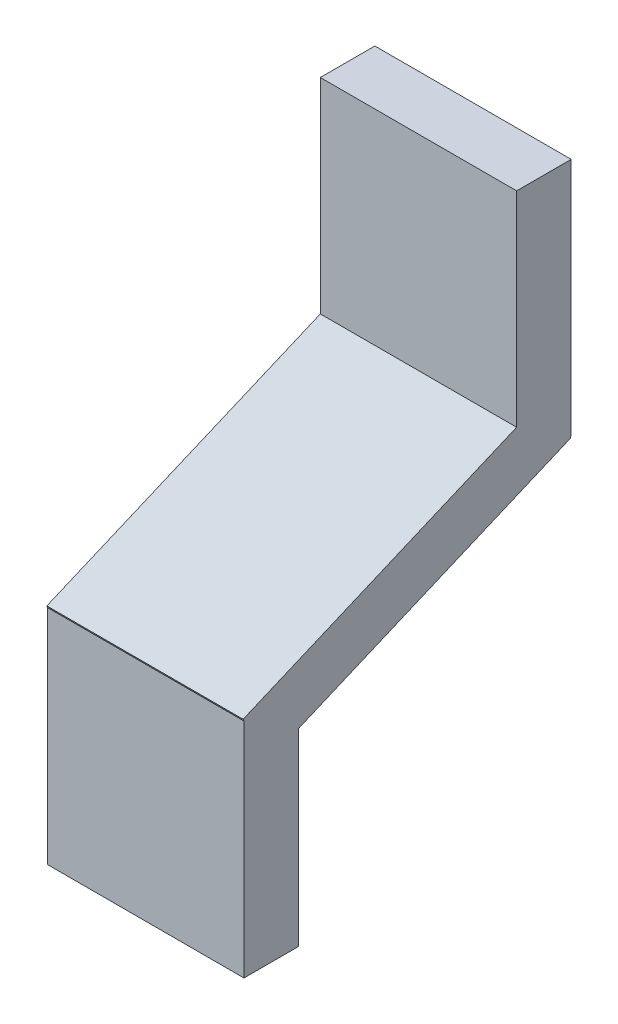
ISO-10303-21;
HEADER;
FILE_DESCRIPTION(('STEP AP214'),'2;1');
FILE_NAME('part.step','',(''),(''),'','','');
FILE_SCHEMA(('AUTOMOTIVE_DESIGN { 1 0 10303 214 1 1 1 1 }'));
ENDSEC;
DATA;
#1=APPLICATION_CONTEXT('core data for automotive mechanical design processes');
#2=APPLICATION_PROTOCOL_DEFINITION('international standard','automotive_design',2000,#1);
#3=PRODUCT_CONTEXT('',#1,'mechanical');
#4=PRODUCT('Part','Part','',(#3));
#5=PRODUCT_RELATED_PRODUCT_CATEGORY('part','',(#4));
#6=PRODUCT_DEFINITION_FORMATION('','',#4);
#7=PRODUCT_DEFINITION_CONTEXT('part definition',#1,'design');
#8=PRODUCT_DEFINITION('design','',#6,#7);
#9=PRODUCT_DEFINITION_SHAPE('','',#8);
#10=(LENGTH_UNIT() NAMED_UNIT(*) SI_UNIT(.MILLI.,.METRE.));
#11=(NAMED_UNIT(*) PLANE_ANGLE_UNIT() SI_UNIT($,.RADIAN.));
#12=(NAMED_UNIT(*) SI_UNIT($,.STERADIAN.) SOLID_ANGLE_UNIT());
#13=UNCERTAINTY_MEASURE_WITH_UNIT(LENGTH_MEASURE(1.E-05),#10,'distance_accuracy_value','');
#14=(GEOMETRIC_REPRESENTATION_CONTEXT(3) GLOBAL_UNCERTAINTY_ASSIGNED_CONTEXT((#13)) GLOBAL_UNIT_ASSIGNED_CONTEXT((#10,
#11,#12)) REPRESENTATION_CONTEXT('',''));
#15=CARTESIAN_POINT('',(0.,0.,0.));
#16=DIRECTION('',(0.,0.,1.));
#17=DIRECTION('',(1.,0.,0.));
#18=AXIS2_PLACEMENT_3D('',#15,#16,#17);
#19=CARTESIAN_POINT('',(4.22,11.,0.5));
#20=DIRECTION('',(0.,0.,1.));
#21=DIRECTION('',(1.,0.,0.));
#22=AXIS2_PLACEMENT_3D('',#19,#20,#21);
#23=PLANE('',#22);
#24=DIRECTION('',(1.,0.,0.));
#25=VECTOR('',#24,1.);
#26=CARTESIAN_POINT('',(4.22,11.3461054439247,0.500000000000314));
#27=LINE('',#26,#25);
#28=CARTESIAN_POINT('',(4.580000014305,11.3461054439242,0.500000000000105));
#29=VERTEX_POINT('',#28);
#30=CARTESIAN_POINT('',(4.22,11.3461054439243,0.500000000000105));
#31=VERTEX_POINT('',#30);
#32=EDGE_CURVE('E148',#29,#31,#27,.F.);
#33=ORIENTED_EDGE('',*,*,#32,.F.);
#34=DIRECTION('',(0.,1.,0.));
#35=VECTOR('',#34,1.);
#36=CARTESIAN_POINT('',(4.580000014305,11.65,0.5));
#37=LINE('',#36,#35);
#38=CARTESIAN_POINT('',(4.580000014305,11.,0.5));
#39=VERTEX_POINT('',#38);
#40=EDGE_CURVE('E154',#39,#29,#37,.T.);
#41=ORIENTED_EDGE('',*,*,#40,.F.);
#42=DIRECTION('',(1.,0.,0.));
#43=VECTOR('',#42,1.);
#44=CARTESIAN_POINT('',(4.22,11.,0.5));
#45=LINE('',#44,#43);
#46=CARTESIAN_POINT('',(4.22,11.,0.5));
#47=VERTEX_POINT('',#46);
#48=EDGE_CURVE('E135',#39,#47,#45,.F.);
#49=ORIENTED_EDGE('',*,*,#48,.T.);
#50=DIRECTION('',(0.,1.,0.));
#51=VECTOR('',#50,1.);
#52=CARTESIAN_POINT('',(4.22,11.65,0.5));
#53=LINE('',#52,#51);
#54=EDGE_CURVE('E182',#47,#31,#53,.T.);
#55=ORIENTED_EDGE('',*,*,#54,.T.);
#56=EDGE_LOOP('',(#33,#41,#49,#55));
#57=FACE_BOUND('',#56,.T.);
#58=ADVANCED_FACE('F17',(#57),#23,.F.);
#59=CARTESIAN_POINT('',(4.22,11.557949520001,0.0009268707435866));
#60=DIRECTION('',(0.,-0.920504786278108,-0.390731286742046));
#61=DIRECTION('',(0.,0.390731286742046,-0.920504786278108));
#62=AXIS2_PLACEMENT_3D('',#59,#60,#61);
#63=PLANE('',#62);
#64=DIRECTION('',(0.,0.39073128674346,-0.920504786277508));
#65=VECTOR('',#64,1.);
#66=CARTESIAN_POINT('',(4.580000014305,11.346105443924,0.5));
#67=LINE('',#66,#65);
#68=CARTESIAN_POINT('',(4.580000014305,11.557949520001,0.000926870743687937));
#69=VERTEX_POINT('',#68);
#70=EDGE_CURVE('E151',#29,#69,#67,.T.);
#71=ORIENTED_EDGE('',*,*,#70,.F.);
#72=ORIENTED_EDGE('',*,*,#32,.T.);
#73=DIRECTION('',(0.,0.39073128674346,-0.920504786277508));
#74=VECTOR('',#73,1.);
#75=CARTESIAN_POINT('',(4.22,11.346105443924,0.5));
#76=LINE('',#75,#74);
#77=CARTESIAN_POINT('',(4.22,11.557949520001,0.000926870743697301));
#78=VERTEX_POINT('',#77);
#79=EDGE_CURVE('E178',#31,#78,#76,.T.);
#80=ORIENTED_EDGE('',*,*,#79,.T.);
#81=DIRECTION('',(1.,0.,0.));
#82=VECTOR('',#81,1.);
#83=CARTESIAN_POINT('',(4.22,11.557949520001,0.00092687074374427));
#84=LINE('',#83,#82);
#85=EDGE_CURVE('E145',#78,#69,#84,.T.);
#86=ORIENTED_EDGE('',*,*,#85,.T.);
#87=EDGE_LOOP('',(#71,#72,#80,#86));
#88=FACE_BOUND('',#87,.T.);
#89=ADVANCED_FACE('F242',(#88),#63,.T.);
#90=CARTESIAN_POINT('',(4.22,11.65,0.04));
#91=DIRECTION('',(0.,-0.390731286742046,0.920504786278108));
#92=DIRECTION('',(0.,-0.920504786278108,-0.390731286742046));
#93=AXIS2_PLACEMENT_3D('',#90,#91,#92);
#94=PLANE('',#93);
#95=DIRECTION('',(0.,0.920504786259214,0.390731286786557));
#96=VECTOR('',#95,1.);
#97=CARTESIAN_POINT('',(4.22,11.557949520001,0.000926870743659899));
#98=LINE('',#97,#96);
#99=CARTESIAN_POINT('',(4.22,11.56,0.001797248280528));
#100=VERTEX_POINT('',#99);
#101=EDGE_CURVE('E123',#78,#100,#98,.T.);
#102=ORIENTED_EDGE('',*,*,#101,.T.);
#103=DIRECTION('',(1.,0.,0.));
#104=VECTOR('',#103,1.);
#105=CARTESIAN_POINT('',(4.22,11.56,0.001797248280528));
#106=LINE('',#105,#104);
#107=CARTESIAN_POINT('',(4.580000014305,11.56,0.001797248280528));
#108=VERTEX_POINT('',#107);
#109=EDGE_CURVE('E97',#100,#108,#106,.T.);
#110=ORIENTED_EDGE('',*,*,#109,.T.);
#111=DIRECTION('',(0.,0.920504786259214,0.390731286786557));
#112=VECTOR('',#111,1.);
#113=CARTESIAN_POINT('',(4.580000014305,11.557949520001,0.000926870743659899));
#114=LINE('',#113,#112);
#115=EDGE_CURVE('E153',#69,#108,#114,.T.);
#116=ORIENTED_EDGE('',*,*,#115,.F.);
#117=ORIENTED_EDGE('',*,*,#85,.F.);
#118=EDGE_LOOP('',(#102,#110,#116,#117));
#119=FACE_BOUND('',#118,.T.);
#120=ADVANCED_FACE('F243',(#119),#94,.F.);
#121=CARTESIAN_POINT('',(4.22,11.56,0.));
#122=DIRECTION('',(0.,1.,0.));
#123=DIRECTION('',(0.,0.,1.));
#124=AXIS2_PLACEMENT_3D('',#121,#122,#123);
#125=PLANE('',#124);
#126=ORIENTED_EDGE('',*,*,#109,.F.);
#127=DIRECTION('',(0.,0.,1.));
#128=VECTOR('',#127,1.);
#129=CARTESIAN_POINT('',(4.22,11.56,0.));
#130=LINE('',#129,#128);
#131=CARTESIAN_POINT('',(4.22,11.56,0.));
#132=VERTEX_POINT('',#131);
#133=EDGE_CURVE('E20',#100,#132,#130,.F.);
#134=ORIENTED_EDGE('',*,*,#133,.T.);
#135=DIRECTION('',(1.,0.,0.));
#136=VECTOR('',#135,1.);
#137=CARTESIAN_POINT('',(4.22,11.56,0.));
#138=LINE('',#137,#136);
#139=CARTESIAN_POINT('',(4.580000014305,11.56,0.));
#140=VERTEX_POINT('',#139);
#141=EDGE_CURVE('E104',#132,#140,#138,.T.);
#142=ORIENTED_EDGE('',*,*,#141,.T.);
#143=DIRECTION('',(0.,0.,-1.));
#144=VECTOR('',#143,1.);
#145=CARTESIAN_POINT('',(4.580000014305,11.56,0.04));
#146=LINE('',#145,#144);
#147=EDGE_CURVE('E194',#108,#140,#146,.T.);
#148=ORIENTED_EDGE('',*,*,#147,.F.);
#149=EDGE_LOOP('',(#126,#134,#142,#148));
#150=FACE_BOUND('',#149,.T.);
#151=ADVANCED_FACE('F122',(#150),#125,.F.);
#152=CARTESIAN_POINT('',(4.22,11.56,0.));
#153=DIRECTION('',(0.,0.,1.));
#154=DIRECTION('',(1.,0.,0.));
#155=AXIS2_PLACEMENT_3D('',#152,#153,#154);
#156=PLANE('',#155);
#157=ORIENTED_EDGE('',*,*,#141,.F.);
#158=DIRECTION('',(0.,1.,0.));
#159=VECTOR('',#158,1.);
#160=CARTESIAN_POINT('',(4.22,11.65,0.));
#161=LINE('',#160,#159);
#162=CARTESIAN_POINT('',(4.22,11.999999997616,0.));
#163=VERTEX_POINT('',#162);
#164=EDGE_CURVE('E108',#132,#163,#161,.T.);
#165=ORIENTED_EDGE('',*,*,#164,.T.);
#166=DIRECTION('',(1.,0.,0.));
#167=VECTOR('',#166,1.);
#168=CARTESIAN_POINT('',(4.22,11.999999997616,0.));
#169=LINE('',#168,#167);
#170=CARTESIAN_POINT('',(4.580000014305,11.999999997616,0.));
#171=VERTEX_POINT('',#170);
#172=EDGE_CURVE('E110',#171,#163,#169,.F.);
#173=ORIENTED_EDGE('',*,*,#172,.F.);
#174=DIRECTION('',(0.,1.,0.));
#175=VECTOR('',#174,1.);
#176=CARTESIAN_POINT('',(4.580000014305,11.65,0.));
#177=LINE('',#176,#175);
#178=EDGE_CURVE('E109',#140,#171,#177,.T.);
#179=ORIENTED_EDGE('',*,*,#178,.F.);
#180=EDGE_LOOP('',(#157,#165,#173,#179));
#181=FACE_BOUND('',#180,.T.);
#182=ADVANCED_FACE('F106',(#181),#156,.F.);
#183=CARTESIAN_POINT('',(4.22,11.999999997616,0.));
#184=DIRECTION('',(0.,1.,0.));
#185=DIRECTION('',(0.,0.,1.));
#186=AXIS2_PLACEMENT_3D('',#183,#184,#185);
#187=PLANE('',#186);
#188=ORIENTED_EDGE('',*,*,#172,.T.);
#189=DIRECTION('',(0.,0.,-1.));
#190=VECTOR('',#189,1.);
#191=CARTESIAN_POINT('',(4.22,11.999999997616,0.04));
#192=LINE('',#191,#190);
#193=CARTESIAN_POINT('',(4.22,11.999999997616,0.10000000149));
#194=VERTEX_POINT('',#193);
#195=EDGE_CURVE('E120',#163,#194,#192,.F.);
#196=ORIENTED_EDGE('',*,*,#195,.T.);
#197=DIRECTION('',(1.,0.,0.));
#198=VECTOR('',#197,1.);
#199=CARTESIAN_POINT('',(4.22,11.999999997616,0.10000000149));
#200=LINE('',#199,#198);
#201=CARTESIAN_POINT('',(4.580000014305,11.999999997616,0.10000000149));
#202=VERTEX_POINT('',#201);
#203=EDGE_CURVE('E181',#202,#194,#200,.F.);
#204=ORIENTED_EDGE('',*,*,#203,.F.);
#205=DIRECTION('',(0.,0.,-1.));
#206=VECTOR('',#205,1.);
#207=CARTESIAN_POINT('',(4.580000014305,11.999999997616,0.04));
#208=LINE('',#207,#206);
#209=EDGE_CURVE('E140',#171,#202,#208,.F.);
#210=ORIENTED_EDGE('',*,*,#209,.F.);
#211=EDGE_LOOP('',(#188,#196,#204,#210));
#212=FACE_BOUND('',#211,.T.);
#213=ADVANCED_FACE('F271',(#212),#187,.T.);
#214=CARTESIAN_POINT('',(4.22,11.,0.60000000149));
#215=DIRECTION('',(0.,0.,1.));
#216=DIRECTION('',(1.,0.,0.));
#217=AXIS2_PLACEMENT_3D('',#214,#215,#216);
#218=PLANE('',#217);
#219=DIRECTION('',(0.,1.,0.));
#220=VECTOR('',#219,1.);
#221=CARTESIAN_POINT('',(4.580000014305,11.65,0.60000000149));
#222=LINE('',#221,#220);
#223=CARTESIAN_POINT('',(4.580000014305,11.408101447657,0.600000001490072));
#224=VERTEX_POINT('',#223);
#225=CARTESIAN_POINT('',(4.580000014305,11.,0.60000000149));
#226=VERTEX_POINT('',#225);
#227=EDGE_CURVE('E168',#224,#226,#222,.F.);
#228=ORIENTED_EDGE('',*,*,#227,.F.);
#229=DIRECTION('',(1.,0.,0.));
#230=VECTOR('',#229,1.);
#231=CARTESIAN_POINT('',(4.22,11.4081014476569,0.600000001490144));
#232=LINE('',#231,#230);
#233=CARTESIAN_POINT('',(4.22,11.408101447657,0.600000001490072));
#234=VERTEX_POINT('',#233);
#235=EDGE_CURVE('E124',#234,#224,#232,.T.);
#236=ORIENTED_EDGE('',*,*,#235,.F.);
#237=DIRECTION('',(0.,1.,0.));
#238=VECTOR('',#237,1.);
#239=CARTESIAN_POINT('',(4.22,11.65,0.60000000149));
#240=LINE('',#239,#238);
#241=CARTESIAN_POINT('',(4.22,11.,0.60000000149));
#242=VERTEX_POINT('',#241);
#243=EDGE_CURVE('E192',#234,#242,#240,.F.);
#244=ORIENTED_EDGE('',*,*,#243,.T.);
#245=DIRECTION('',(1.,0.,0.));
#246=VECTOR('',#245,1.);
#247=CARTESIAN_POINT('',(4.22,11.,0.60000000149));
#248=LINE('',#247,#246);
#249=EDGE_CURVE('E127',#242,#226,#248,.T.);
#250=ORIENTED_EDGE('',*,*,#249,.T.);
#251=EDGE_LOOP('',(#228,#236,#244,#250));
#252=FACE_BOUND('',#251,.T.);
#253=ADVANCED_FACE('F232',(#252),#218,.T.);
#254=CARTESIAN_POINT('',(4.22,11.,0.5));
#255=DIRECTION('',(0.,1.,0.));
#256=DIRECTION('',(0.,0.,1.));
#257=AXIS2_PLACEMENT_3D('',#254,#255,#256);
#258=PLANE('',#257);
#259=DIRECTION('',(0.,0.,-1.));
#260=VECTOR('',#259,1.);
#261=CARTESIAN_POINT('',(4.22,11.,0.04));
#262=LINE('',#261,#260);
#263=EDGE_CURVE('E187',#242,#47,#262,.T.);
#264=ORIENTED_EDGE('',*,*,#263,.T.);
#265=ORIENTED_EDGE('',*,*,#48,.F.);
#266=DIRECTION('',(0.,0.,-1.));
#267=VECTOR('',#266,1.);
#268=CARTESIAN_POINT('',(4.580000014305,11.,0.04));
#269=LINE('',#268,#267);
#270=EDGE_CURVE('E164',#226,#39,#269,.T.);
#271=ORIENTED_EDGE('',*,*,#270,.F.);
#272=ORIENTED_EDGE('',*,*,#249,.F.);
#273=EDGE_LOOP('',(#264,#265,#271,#272));
#274=FACE_BOUND('',#273,.T.);
#275=ADVANCED_FACE('F235',(#274),#258,.F.);
#276=CARTESIAN_POINT('',(4.22,11.411653909498,0.601507932798));
#277=DIRECTION('',(0.,-0.390731286742046,0.920504786278108));
#278=DIRECTION('',(0.,-0.920504786278108,-0.390731286742046));
#279=AXIS2_PLACEMENT_3D('',#276,#277,#278);
#280=PLANE('',#279);
#281=ORIENTED_EDGE('',*,*,#235,.T.);
#282=DIRECTION('',(0.,-0.920504786262243,-0.390731286779422));
#283=VECTOR('',#282,1.);
#284=CARTESIAN_POINT('',(4.580000014305,11.411653909498,0.601507932798));
#285=LINE('',#284,#283);
#286=CARTESIAN_POINT('',(4.580000014305,11.4116539094979,0.601507932797974));
#287=VERTEX_POINT('',#286);
#288=EDGE_CURVE('E227',#287,#224,#285,.T.);
#289=ORIENTED_EDGE('',*,*,#288,.F.);
#290=DIRECTION('',(1.,0.,0.));
#291=VECTOR('',#290,1.);
#292=CARTESIAN_POINT('',(4.22,11.4116539094978,0.601507932797897));
#293=LINE('',#292,#291);
#294=CARTESIAN_POINT('',(4.22,11.4116539094979,0.601507932797974));
#295=VERTEX_POINT('',#294);
#296=EDGE_CURVE('E167',#287,#295,#293,.F.);
#297=ORIENTED_EDGE('',*,*,#296,.T.);
#298=DIRECTION('',(0.,-0.920504786262243,-0.390731286779422));
#299=VECTOR('',#298,1.);
#300=CARTESIAN_POINT('',(4.22,11.411653909498,0.601507932798));
#301=LINE('',#300,#299);
#302=EDGE_CURVE('E175',#295,#234,#301,.T.);
#303=ORIENTED_EDGE('',*,*,#302,.T.);
#304=EDGE_LOOP('',(#281,#289,#297,#303));
#305=FACE_BOUND('',#304,.T.);
#306=ADVANCED_FACE('F210',(#305),#280,.T.);
#307=CARTESIAN_POINT('',(4.22,11.65,0.04));
#308=DIRECTION('',(1.,0.,0.));
#309=DIRECTION('',(0.,0.,-1.));
#310=AXIS2_PLACEMENT_3D('',#307,#308,#309);
#311=PLANE('',#310);
#312=ORIENTED_EDGE('',*,*,#54,.F.);
#313=ORIENTED_EDGE('',*,*,#263,.F.);
#314=ORIENTED_EDGE('',*,*,#243,.F.);
#315=ORIENTED_EDGE('',*,*,#302,.F.);
#316=DIRECTION('',(0.,0.390731286742046,-0.920504786278108));
#317=VECTOR('',#316,1.);
#318=CARTESIAN_POINT('',(4.22,11.65,0.04));
#319=LINE('',#318,#317);
#320=CARTESIAN_POINT('',(4.22,11.624531498221,0.100000001490019));
#321=VERTEX_POINT('',#320);
#322=EDGE_CURVE('E216',#295,#321,#319,.T.);
#323=ORIENTED_EDGE('',*,*,#322,.T.);
#324=DIRECTION('',(0.,1.,0.));
#325=VECTOR('',#324,1.);
#326=CARTESIAN_POINT('',(4.22,11.56,0.10000000149));
#327=LINE('',#326,#325);
#328=EDGE_CURVE('E161',#194,#321,#327,.F.);
#329=ORIENTED_EDGE('',*,*,#328,.F.);
#330=ORIENTED_EDGE('',*,*,#195,.F.);
#331=ORIENTED_EDGE('',*,*,#164,.F.);
#332=ORIENTED_EDGE('',*,*,#133,.F.);
#333=ORIENTED_EDGE('',*,*,#101,.F.);
#334=ORIENTED_EDGE('',*,*,#79,.F.);
#335=EDGE_LOOP('',(#312,#313,#314,#315,#323,#329,#330,#331,#332,#333,#334));
#336=FACE_BOUND('',#335,.T.);
#337=ADVANCED_FACE('F115',(#336),#311,.F.);
#338=CARTESIAN_POINT('',(4.22,11.56,0.10000000149));
#339=DIRECTION('',(0.,0.,1.));
#340=DIRECTION('',(1.,0.,0.));
#341=AXIS2_PLACEMENT_3D('',#338,#339,#340);
#342=PLANE('',#341);
#343=ORIENTED_EDGE('',*,*,#328,.T.);
#344=DIRECTION('',(1.,0.,0.));
#345=VECTOR('',#344,1.);
#346=CARTESIAN_POINT('',(4.22,11.6245314982212,0.100000001490075));
#347=LINE('',#346,#345);
#348=CARTESIAN_POINT('',(4.580000014305,11.624531498221,0.100000001490019));
#349=VERTEX_POINT('',#348);
#350=EDGE_CURVE('E26',#321,#349,#347,.T.);
#351=ORIENTED_EDGE('',*,*,#350,.T.);
#352=DIRECTION('',(0.,1.,0.));
#353=VECTOR('',#352,1.);
#354=CARTESIAN_POINT('',(4.580000014305,11.65,0.10000000149));
#355=LINE('',#354,#353);
#356=EDGE_CURVE('E34',#202,#349,#355,.F.);
#357=ORIENTED_EDGE('',*,*,#356,.F.);
#358=ORIENTED_EDGE('',*,*,#203,.T.);
#359=EDGE_LOOP('',(#343,#351,#357,#358));
#360=FACE_BOUND('',#359,.T.);
#361=ADVANCED_FACE('F257',(#360),#342,.T.);
#362=CARTESIAN_POINT('',(4.580000014305,11.65,0.04));
#363=DIRECTION('',(1.,0.,0.));
#364=DIRECTION('',(0.,0.,-1.));
#365=AXIS2_PLACEMENT_3D('',#362,#363,#364);
#366=PLANE('',#365);
#367=ORIENTED_EDGE('',*,*,#227,.T.);
#368=ORIENTED_EDGE('',*,*,#270,.T.);
#369=ORIENTED_EDGE('',*,*,#40,.T.);
#370=ORIENTED_EDGE('',*,*,#70,.T.);
#371=ORIENTED_EDGE('',*,*,#115,.T.);
#372=ORIENTED_EDGE('',*,*,#147,.T.);
#373=ORIENTED_EDGE('',*,*,#178,.T.);
#374=ORIENTED_EDGE('',*,*,#209,.T.);
#375=ORIENTED_EDGE('',*,*,#356,.T.);
#376=DIRECTION('',(0.,0.390731286742046,-0.920504786278108));
#377=VECTOR('',#376,1.);
#378=CARTESIAN_POINT('',(4.580000014305,11.65,0.04));
#379=LINE('',#378,#377);
#380=EDGE_CURVE('E11',#349,#287,#379,.F.);
#381=ORIENTED_EDGE('',*,*,#380,.T.);
#382=ORIENTED_EDGE('',*,*,#288,.T.);
#383=EDGE_LOOP('',(#367,#368,#369,#370,#371,#372,#373,#374,#375,#381,#382));
#384=FACE_BOUND('',#383,.T.);
#385=ADVANCED_FACE('F230',(#384),#366,.T.);
#386=CARTESIAN_POINT('',(4.22,11.65,0.04));
#387=DIRECTION('',(0.,-0.920504786278108,-0.390731286742046));
#388=DIRECTION('',(0.,0.390731286742046,-0.920504786278108));
#389=AXIS2_PLACEMENT_3D('',#386,#387,#388);
#390=PLANE('',#389);
#391=ORIENTED_EDGE('',*,*,#350,.F.);
#392=ORIENTED_EDGE('',*,*,#322,.F.);
#393=ORIENTED_EDGE('',*,*,#296,.F.);
#394=ORIENTED_EDGE('',*,*,#380,.F.);
#395=EDGE_LOOP('',(#391,#392,#393,#394));
#396=FACE_BOUND('',#395,.T.);
#397=ADVANCED_FACE('F220',(#396),#390,.F.);
#398=CLOSED_SHELL('',(#58,#89,#120,#151,#182,#213,#253,#275,#306,#337,#361,#385,#397));
#399=MANIFOLD_SOLID_BREP('B1',#398);
#400=ADVANCED_BREP_SHAPE_REPRESENTATION('',(#18,#399),#14);
#401=SHAPE_DEFINITION_REPRESENTATION(#9,#400);
ENDSEC;
END-ISO-10303-21;
